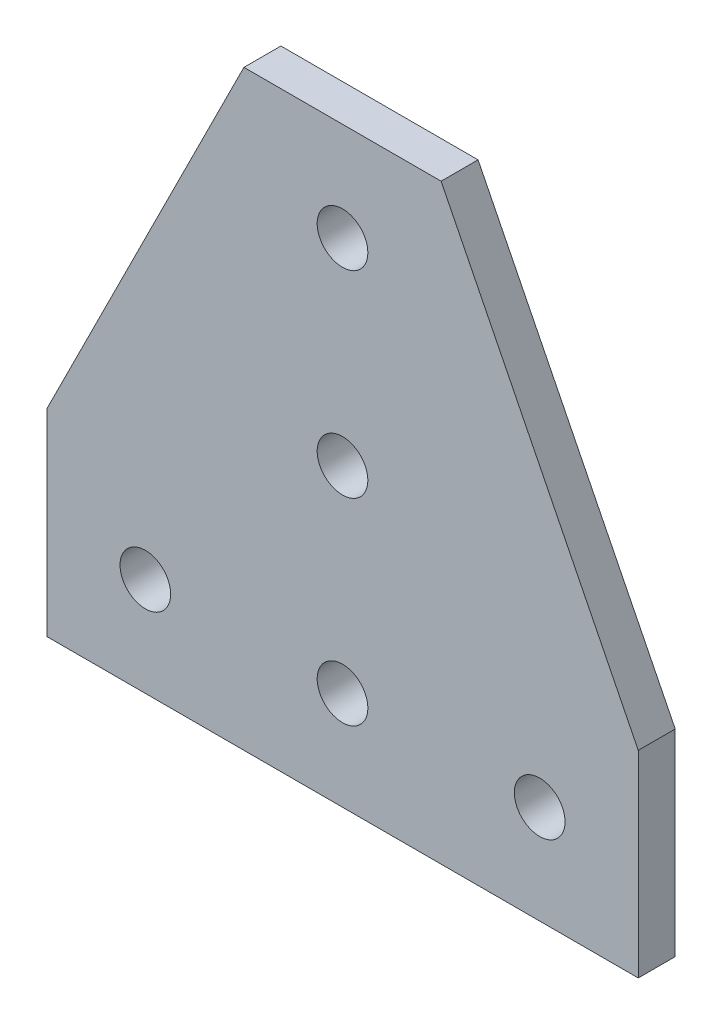
ISO-10303-21;
HEADER;
FILE_DESCRIPTION(('STEP AP214'),'2;1');
FILE_NAME('part.step','',(''),(''),'','','');
FILE_SCHEMA(('AUTOMOTIVE_DESIGN { 1 0 10303 214 1 1 1 1 }'));
ENDSEC;
DATA;
#1=APPLICATION_CONTEXT('core data for automotive mechanical design processes');
#2=APPLICATION_PROTOCOL_DEFINITION('international standard','automotive_design',2000,#1);
#3=PRODUCT_CONTEXT('',#1,'mechanical');
#4=PRODUCT('Part','Part','',(#3));
#5=PRODUCT_RELATED_PRODUCT_CATEGORY('part','',(#4));
#6=PRODUCT_DEFINITION_FORMATION('','',#4);
#7=PRODUCT_DEFINITION_CONTEXT('part definition',#1,'design');
#8=PRODUCT_DEFINITION('design','',#6,#7);
#9=PRODUCT_DEFINITION_SHAPE('','',#8);
#10=(LENGTH_UNIT() NAMED_UNIT(*) SI_UNIT(.MILLI.,.METRE.));
#11=(NAMED_UNIT(*) PLANE_ANGLE_UNIT() SI_UNIT($,.RADIAN.));
#12=(NAMED_UNIT(*) SI_UNIT($,.STERADIAN.) SOLID_ANGLE_UNIT());
#13=UNCERTAINTY_MEASURE_WITH_UNIT(LENGTH_MEASURE(1.E-05),#10,'distance_accuracy_value','');
#14=(GEOMETRIC_REPRESENTATION_CONTEXT(3) GLOBAL_UNCERTAINTY_ASSIGNED_CONTEXT((#13)) GLOBAL_UNIT_ASSIGNED_CONTEXT((#10,
#11,#12)) REPRESENTATION_CONTEXT('',''));
#15=CARTESIAN_POINT('',(0.,0.,0.));
#16=DIRECTION('',(0.,0.,1.));
#17=DIRECTION('',(1.,0.,0.));
#18=AXIS2_PLACEMENT_3D('',#15,#16,#17);
#19=CARTESIAN_POINT('',(0.,0.,2.38125));
#20=DIRECTION('',(0.,0.,-1.));
#21=DIRECTION('',(-1.,0.,0.));
#22=AXIS2_PLACEMENT_3D('',#19,#20,#21);
#23=PLANE('',#22);
#24=CARTESIAN_POINT('',(38.1,63.5,2.38125));
#25=DIRECTION('',(0.,0.,1.));
#26=DIRECTION('',(1.,0.,0.));
#27=AXIS2_PLACEMENT_3D('',#24,#25,#26);
#28=CIRCLE('',#27,3.26390000000001);
#29=CARTESIAN_POINT('',(41.3639,63.5,2.38125));
#30=VERTEX_POINT('',#29);
#31=EDGE_CURVE('E195',#30,#30,#28,.T.);
#32=ORIENTED_EDGE('',*,*,#31,.F.);
#33=EDGE_LOOP('',(#32));
#34=FACE_BOUND('',#33,.T.);
#35=CARTESIAN_POINT('',(38.1,12.7,2.38125));
#36=DIRECTION('',(0.,0.,1.));
#37=DIRECTION('',(1.,0.,0.));
#38=AXIS2_PLACEMENT_3D('',#35,#36,#37);
#39=CIRCLE('',#38,3.26389999999999);
#40=CARTESIAN_POINT('',(41.3639,12.7,2.38125));
#41=VERTEX_POINT('',#40);
#42=EDGE_CURVE('E207',#41,#41,#39,.T.);
#43=ORIENTED_EDGE('',*,*,#42,.F.);
#44=EDGE_LOOP('',(#43));
#45=FACE_BOUND('',#44,.T.);
#46=DIRECTION('',(1.,0.,0.));
#47=VECTOR('',#46,1.);
#48=CARTESIAN_POINT('',(76.2,0.,2.38125));
#49=LINE('',#48,#47);
#50=CARTESIAN_POINT('',(0.,0.,2.38125));
#51=VERTEX_POINT('',#50);
#52=CARTESIAN_POINT('',(76.2,0.,2.38125));
#53=VERTEX_POINT('',#52);
#54=EDGE_CURVE('E130',#51,#53,#49,.T.);
#55=ORIENTED_EDGE('',*,*,#54,.T.);
#56=DIRECTION('',(0.,1.,0.));
#57=VECTOR('',#56,1.);
#58=CARTESIAN_POINT('',(76.2,25.4,2.38125));
#59=LINE('',#58,#57);
#60=CARTESIAN_POINT('',(76.2,25.4,2.38125));
#61=VERTEX_POINT('',#60);
#62=EDGE_CURVE('E88',#53,#61,#59,.T.);
#63=ORIENTED_EDGE('',*,*,#62,.T.);
#64=DIRECTION('',(-0.447213595499958,0.894427190999916,0.));
#65=VECTOR('',#64,1.);
#66=CARTESIAN_POINT('',(76.2,25.4,2.38125));
#67=LINE('',#66,#65);
#68=CARTESIAN_POINT('',(50.8,76.2,2.38125));
#69=VERTEX_POINT('',#68);
#70=EDGE_CURVE('E101',#61,#69,#67,.T.);
#71=ORIENTED_EDGE('',*,*,#70,.T.);
#72=DIRECTION('',(-1.,0.,0.));
#73=VECTOR('',#72,1.);
#74=CARTESIAN_POINT('',(25.4,76.2,2.38125));
#75=LINE('',#74,#73);
#76=CARTESIAN_POINT('',(25.4,76.2,2.38125));
#77=VERTEX_POINT('',#76);
#78=EDGE_CURVE('E95',#69,#77,#75,.T.);
#79=ORIENTED_EDGE('',*,*,#78,.T.);
#80=DIRECTION('',(-0.447213595499958,-0.894427190999916,0.));
#81=VECTOR('',#80,1.);
#82=CARTESIAN_POINT('',(0.,25.4,2.38125));
#83=LINE('',#82,#81);
#84=CARTESIAN_POINT('',(0.,25.4,2.38125));
#85=VERTEX_POINT('',#84);
#86=EDGE_CURVE('E99',#77,#85,#83,.T.);
#87=ORIENTED_EDGE('',*,*,#86,.T.);
#88=DIRECTION('',(0.,-1.,0.));
#89=VECTOR('',#88,1.);
#90=CARTESIAN_POINT('',(0.,0.,2.38125));
#91=LINE('',#90,#89);
#92=EDGE_CURVE('E51',#85,#51,#91,.T.);
#93=ORIENTED_EDGE('',*,*,#92,.T.);
#94=EDGE_LOOP('',(#55,#63,#71,#79,#87,#93));
#95=FACE_BOUND('',#94,.T.);
#96=CARTESIAN_POINT('',(12.7,12.7,2.38125));
#97=DIRECTION('',(0.,0.,1.));
#98=DIRECTION('',(1.,0.,0.));
#99=AXIS2_PLACEMENT_3D('',#96,#97,#98);
#100=CIRCLE('',#99,3.2639);
#101=CARTESIAN_POINT('',(15.9639,12.7,2.38125));
#102=VERTEX_POINT('',#101);
#103=EDGE_CURVE('E123',#102,#102,#100,.T.);
#104=ORIENTED_EDGE('',*,*,#103,.F.);
#105=EDGE_LOOP('',(#104));
#106=FACE_BOUND('',#105,.T.);
#107=CARTESIAN_POINT('',(63.5,12.7,2.38125));
#108=DIRECTION('',(0.,0.,1.));
#109=DIRECTION('',(1.,0.,0.));
#110=AXIS2_PLACEMENT_3D('',#107,#108,#109);
#111=CIRCLE('',#110,3.26389999999999);
#112=CARTESIAN_POINT('',(66.7639,12.7,2.38125));
#113=VERTEX_POINT('',#112);
#114=EDGE_CURVE('E201',#113,#113,#111,.T.);
#115=ORIENTED_EDGE('',*,*,#114,.F.);
#116=EDGE_LOOP('',(#115));
#117=FACE_BOUND('',#116,.T.);
#118=CARTESIAN_POINT('',(38.1,38.1,2.38125));
#119=DIRECTION('',(0.,0.,1.));
#120=DIRECTION('',(1.,0.,0.));
#121=AXIS2_PLACEMENT_3D('',#118,#119,#120);
#122=CIRCLE('',#121,3.26389999999999);
#123=CARTESIAN_POINT('',(41.3639,38.1,2.38125));
#124=VERTEX_POINT('',#123);
#125=EDGE_CURVE('E186',#124,#124,#122,.T.);
#126=ORIENTED_EDGE('',*,*,#125,.F.);
#127=EDGE_LOOP('',(#126));
#128=FACE_BOUND('',#127,.T.);
#129=ADVANCED_FACE('F34',(#34,#45,#95,#106,#117,#128),#23,.F.);
#130=CARTESIAN_POINT('',(0.,0.,-2.38125));
#131=DIRECTION('',(0.,0.,-1.));
#132=DIRECTION('',(-1.,0.,0.));
#133=AXIS2_PLACEMENT_3D('',#130,#131,#132);
#134=PLANE('',#133);
#135=CARTESIAN_POINT('',(38.1,63.5,-2.38125));
#136=DIRECTION('',(0.,0.,1.));
#137=DIRECTION('',(1.,0.,0.));
#138=AXIS2_PLACEMENT_3D('',#135,#136,#137);
#139=CIRCLE('',#138,3.26390000000001);
#140=CARTESIAN_POINT('',(41.3639,63.5,-2.38125));
#141=VERTEX_POINT('',#140);
#142=EDGE_CURVE('E192',#141,#141,#139,.T.);
#143=ORIENTED_EDGE('',*,*,#142,.T.);
#144=EDGE_LOOP('',(#143));
#145=FACE_BOUND('',#144,.T.);
#146=CARTESIAN_POINT('',(38.1,12.7,-2.38125));
#147=DIRECTION('',(0.,0.,1.));
#148=DIRECTION('',(1.,0.,0.));
#149=AXIS2_PLACEMENT_3D('',#146,#147,#148);
#150=CIRCLE('',#149,3.26389999999999);
#151=CARTESIAN_POINT('',(41.3639,12.7,-2.38125));
#152=VERTEX_POINT('',#151);
#153=EDGE_CURVE('E204',#152,#152,#150,.T.);
#154=ORIENTED_EDGE('',*,*,#153,.T.);
#155=EDGE_LOOP('',(#154));
#156=FACE_BOUND('',#155,.T.);
#157=DIRECTION('',(1.,0.,0.));
#158=VECTOR('',#157,1.);
#159=CARTESIAN_POINT('',(76.2,0.,-2.38125));
#160=LINE('',#159,#158);
#161=CARTESIAN_POINT('',(0.,0.,-2.38125));
#162=VERTEX_POINT('',#161);
#163=CARTESIAN_POINT('',(76.2,0.,-2.38125));
#164=VERTEX_POINT('',#163);
#165=EDGE_CURVE('E119',#162,#164,#160,.T.);
#166=ORIENTED_EDGE('',*,*,#165,.F.);
#167=DIRECTION('',(0.,-1.,0.));
#168=VECTOR('',#167,1.);
#169=CARTESIAN_POINT('',(0.,0.,-2.38125));
#170=LINE('',#169,#168);
#171=CARTESIAN_POINT('',(0.,25.4,-2.38125));
#172=VERTEX_POINT('',#171);
#173=EDGE_CURVE('E80',#172,#162,#170,.T.);
#174=ORIENTED_EDGE('',*,*,#173,.F.);
#175=DIRECTION('',(-0.447213595499958,-0.894427190999916,0.));
#176=VECTOR('',#175,1.);
#177=CARTESIAN_POINT('',(0.,25.4,-2.38125));
#178=LINE('',#177,#176);
#179=CARTESIAN_POINT('',(25.4,76.2,-2.38125));
#180=VERTEX_POINT('',#179);
#181=EDGE_CURVE('E74',#180,#172,#178,.T.);
#182=ORIENTED_EDGE('',*,*,#181,.F.);
#183=DIRECTION('',(-1.,0.,0.));
#184=VECTOR('',#183,1.);
#185=CARTESIAN_POINT('',(25.4,76.2,-2.38125));
#186=LINE('',#185,#184);
#187=CARTESIAN_POINT('',(50.8,76.2,-2.38125));
#188=VERTEX_POINT('',#187);
#189=EDGE_CURVE('E109',#188,#180,#186,.T.);
#190=ORIENTED_EDGE('',*,*,#189,.F.);
#191=DIRECTION('',(-0.447213595499958,0.894427190999916,0.));
#192=VECTOR('',#191,1.);
#193=CARTESIAN_POINT('',(76.2,25.4,-2.38125));
#194=LINE('',#193,#192);
#195=CARTESIAN_POINT('',(76.2,25.4,-2.38125));
#196=VERTEX_POINT('',#195);
#197=EDGE_CURVE('E125',#196,#188,#194,.T.);
#198=ORIENTED_EDGE('',*,*,#197,.F.);
#199=DIRECTION('',(0.,1.,0.));
#200=VECTOR('',#199,1.);
#201=CARTESIAN_POINT('',(76.2,25.4,-2.38125));
#202=LINE('',#201,#200);
#203=EDGE_CURVE('E122',#164,#196,#202,.T.);
#204=ORIENTED_EDGE('',*,*,#203,.F.);
#205=EDGE_LOOP('',(#166,#174,#182,#190,#198,#204));
#206=FACE_BOUND('',#205,.T.);
#207=CARTESIAN_POINT('',(12.7,12.7,-2.38125));
#208=DIRECTION('',(0.,0.,1.));
#209=DIRECTION('',(1.,0.,0.));
#210=AXIS2_PLACEMENT_3D('',#207,#208,#209);
#211=CIRCLE('',#210,3.2639);
#212=CARTESIAN_POINT('',(15.9639,12.7,-2.38125));
#213=VERTEX_POINT('',#212);
#214=EDGE_CURVE('E210',#213,#213,#211,.T.);
#215=ORIENTED_EDGE('',*,*,#214,.T.);
#216=EDGE_LOOP('',(#215));
#217=FACE_BOUND('',#216,.T.);
#218=CARTESIAN_POINT('',(63.5,12.7,-2.38125));
#219=DIRECTION('',(0.,0.,1.));
#220=DIRECTION('',(1.,0.,0.));
#221=AXIS2_PLACEMENT_3D('',#218,#219,#220);
#222=CIRCLE('',#221,3.26389999999999);
#223=CARTESIAN_POINT('',(66.7639,12.7,-2.38125));
#224=VERTEX_POINT('',#223);
#225=EDGE_CURVE('E198',#224,#224,#222,.T.);
#226=ORIENTED_EDGE('',*,*,#225,.T.);
#227=EDGE_LOOP('',(#226));
#228=FACE_BOUND('',#227,.T.);
#229=CARTESIAN_POINT('',(38.1,38.1,-2.38125));
#230=DIRECTION('',(0.,0.,1.));
#231=DIRECTION('',(1.,0.,0.));
#232=AXIS2_PLACEMENT_3D('',#229,#230,#231);
#233=CIRCLE('',#232,3.26389999999999);
#234=CARTESIAN_POINT('',(41.3639,38.1,-2.38125));
#235=VERTEX_POINT('',#234);
#236=EDGE_CURVE('E189',#235,#235,#233,.T.);
#237=ORIENTED_EDGE('',*,*,#236,.T.);
#238=EDGE_LOOP('',(#237));
#239=FACE_BOUND('',#238,.T.);
#240=ADVANCED_FACE('F139',(#145,#156,#206,#217,#228,#239),#134,.T.);
#241=CARTESIAN_POINT('',(76.2,0.,2.38125));
#242=DIRECTION('',(0.,1.,0.));
#243=DIRECTION('',(-1.,0.,0.));
#244=AXIS2_PLACEMENT_3D('',#241,#242,#243);
#245=PLANE('',#244);
#246=ORIENTED_EDGE('',*,*,#165,.T.);
#247=DIRECTION('',(0.,0.,-1.));
#248=VECTOR('',#247,1.);
#249=CARTESIAN_POINT('',(76.2,0.,2.38125));
#250=LINE('',#249,#248);
#251=EDGE_CURVE('E11',#53,#164,#250,.T.);
#252=ORIENTED_EDGE('',*,*,#251,.F.);
#253=ORIENTED_EDGE('',*,*,#54,.F.);
#254=DIRECTION('',(0.,0.,-1.));
#255=VECTOR('',#254,1.);
#256=CARTESIAN_POINT('',(0.,0.,2.38125));
#257=LINE('',#256,#255);
#258=EDGE_CURVE('E115',#51,#162,#257,.T.);
#259=ORIENTED_EDGE('',*,*,#258,.T.);
#260=EDGE_LOOP('',(#246,#252,#253,#259));
#261=FACE_BOUND('',#260,.T.);
#262=ADVANCED_FACE('F36',(#261),#245,.F.);
#263=CARTESIAN_POINT('',(76.2,25.4,2.38125));
#264=DIRECTION('',(-1.,0.,0.));
#265=DIRECTION('',(0.,0.,1.));
#266=AXIS2_PLACEMENT_3D('',#263,#264,#265);
#267=PLANE('',#266);
#268=ORIENTED_EDGE('',*,*,#203,.T.);
#269=DIRECTION('',(0.,0.,-1.));
#270=VECTOR('',#269,1.);
#271=CARTESIAN_POINT('',(76.2,25.4,2.38125));
#272=LINE('',#271,#270);
#273=EDGE_CURVE('E43',#61,#196,#272,.T.);
#274=ORIENTED_EDGE('',*,*,#273,.F.);
#275=ORIENTED_EDGE('',*,*,#62,.F.);
#276=ORIENTED_EDGE('',*,*,#251,.T.);
#277=EDGE_LOOP('',(#268,#274,#275,#276));
#278=FACE_BOUND('',#277,.T.);
#279=ADVANCED_FACE('F276',(#278),#267,.F.);
#280=CARTESIAN_POINT('',(76.2,25.4,2.38125));
#281=DIRECTION('',(-0.894427190999916,-0.447213595499958,0.));
#282=DIRECTION('',(0.447213595499958,-0.894427190999916,0.));
#283=AXIS2_PLACEMENT_3D('',#280,#281,#282);
#284=PLANE('',#283);
#285=ORIENTED_EDGE('',*,*,#197,.T.);
#286=DIRECTION('',(0.,0.,-1.));
#287=VECTOR('',#286,1.);
#288=CARTESIAN_POINT('',(50.8,76.2,2.38125));
#289=LINE('',#288,#287);
#290=EDGE_CURVE('E110',#69,#188,#289,.T.);
#291=ORIENTED_EDGE('',*,*,#290,.F.);
#292=ORIENTED_EDGE('',*,*,#70,.F.);
#293=ORIENTED_EDGE('',*,*,#273,.T.);
#294=EDGE_LOOP('',(#285,#291,#292,#293));
#295=FACE_BOUND('',#294,.T.);
#296=ADVANCED_FACE('F136',(#295),#284,.F.);
#297=CARTESIAN_POINT('',(25.4,76.2,2.38125));
#298=DIRECTION('',(0.,-1.,0.));
#299=DIRECTION('',(0.,0.,-1.));
#300=AXIS2_PLACEMENT_3D('',#297,#298,#299);
#301=PLANE('',#300);
#302=ORIENTED_EDGE('',*,*,#189,.T.);
#303=DIRECTION('',(0.,0.,-1.));
#304=VECTOR('',#303,1.);
#305=CARTESIAN_POINT('',(25.4,76.2,2.38125));
#306=LINE('',#305,#304);
#307=EDGE_CURVE('E106',#77,#180,#306,.T.);
#308=ORIENTED_EDGE('',*,*,#307,.F.);
#309=ORIENTED_EDGE('',*,*,#78,.F.);
#310=ORIENTED_EDGE('',*,*,#290,.T.);
#311=EDGE_LOOP('',(#302,#308,#309,#310));
#312=FACE_BOUND('',#311,.T.);
#313=ADVANCED_FACE('F107',(#312),#301,.F.);
#314=CARTESIAN_POINT('',(0.,25.4,2.38125));
#315=DIRECTION('',(0.894427190999916,-0.447213595499958,0.));
#316=DIRECTION('',(0.447213595499958,0.894427190999916,0.));
#317=AXIS2_PLACEMENT_3D('',#314,#315,#316);
#318=PLANE('',#317);
#319=ORIENTED_EDGE('',*,*,#181,.T.);
#320=DIRECTION('',(0.,0.,-1.));
#321=VECTOR('',#320,1.);
#322=CARTESIAN_POINT('',(0.,25.4,2.38125));
#323=LINE('',#322,#321);
#324=EDGE_CURVE('E111',#85,#172,#323,.T.);
#325=ORIENTED_EDGE('',*,*,#324,.F.);
#326=ORIENTED_EDGE('',*,*,#86,.F.);
#327=ORIENTED_EDGE('',*,*,#307,.T.);
#328=EDGE_LOOP('',(#319,#325,#326,#327));
#329=FACE_BOUND('',#328,.T.);
#330=ADVANCED_FACE('F113',(#329),#318,.F.);
#331=CARTESIAN_POINT('',(0.,0.,2.38125));
#332=DIRECTION('',(1.,0.,0.));
#333=DIRECTION('',(0.,0.,-1.));
#334=AXIS2_PLACEMENT_3D('',#331,#332,#333);
#335=PLANE('',#334);
#336=ORIENTED_EDGE('',*,*,#173,.T.);
#337=ORIENTED_EDGE('',*,*,#258,.F.);
#338=ORIENTED_EDGE('',*,*,#92,.F.);
#339=ORIENTED_EDGE('',*,*,#324,.T.);
#340=EDGE_LOOP('',(#336,#337,#338,#339));
#341=FACE_BOUND('',#340,.T.);
#342=ADVANCED_FACE('F144',(#341),#335,.F.);
#343=CARTESIAN_POINT('',(12.7,12.7,2.38125));
#344=DIRECTION('',(0.,0.,-1.));
#345=DIRECTION('',(-1.,0.,0.));
#346=AXIS2_PLACEMENT_3D('',#343,#344,#345);
#347=CYLINDRICAL_SURFACE('',#346,3.2639);
#348=ORIENTED_EDGE('',*,*,#103,.T.);
#349=EDGE_LOOP('',(#348));
#350=FACE_BOUND('',#349,.T.);
#351=ORIENTED_EDGE('',*,*,#214,.F.);
#352=EDGE_LOOP('',(#351));
#353=FACE_BOUND('',#352,.T.);
#354=ADVANCED_FACE('F146',(#350,#353),#347,.F.);
#355=CARTESIAN_POINT('',(38.1,12.7,2.38125));
#356=DIRECTION('',(0.,0.,-1.));
#357=DIRECTION('',(-1.,0.,0.));
#358=AXIS2_PLACEMENT_3D('',#355,#356,#357);
#359=CYLINDRICAL_SURFACE('',#358,3.26389999999999);
#360=ORIENTED_EDGE('',*,*,#42,.T.);
#361=EDGE_LOOP('',(#360));
#362=FACE_BOUND('',#361,.T.);
#363=ORIENTED_EDGE('',*,*,#153,.F.);
#364=EDGE_LOOP('',(#363));
#365=FACE_BOUND('',#364,.T.);
#366=ADVANCED_FACE('F152',(#362,#365),#359,.F.);
#367=CARTESIAN_POINT('',(63.5,12.7,2.38125));
#368=DIRECTION('',(0.,0.,-1.));
#369=DIRECTION('',(-1.,0.,0.));
#370=AXIS2_PLACEMENT_3D('',#367,#368,#369);
#371=CYLINDRICAL_SURFACE('',#370,3.26389999999999);
#372=ORIENTED_EDGE('',*,*,#114,.T.);
#373=EDGE_LOOP('',(#372));
#374=FACE_BOUND('',#373,.T.);
#375=ORIENTED_EDGE('',*,*,#225,.F.);
#376=EDGE_LOOP('',(#375));
#377=FACE_BOUND('',#376,.T.);
#378=ADVANCED_FACE('F169',(#374,#377),#371,.F.);
#379=CARTESIAN_POINT('',(38.1,63.5,2.38125));
#380=DIRECTION('',(0.,0.,-1.));
#381=DIRECTION('',(-1.,0.,0.));
#382=AXIS2_PLACEMENT_3D('',#379,#380,#381);
#383=CYLINDRICAL_SURFACE('',#382,3.26390000000001);
#384=ORIENTED_EDGE('',*,*,#31,.T.);
#385=EDGE_LOOP('',(#384));
#386=FACE_BOUND('',#385,.T.);
#387=ORIENTED_EDGE('',*,*,#142,.F.);
#388=EDGE_LOOP('',(#387));
#389=FACE_BOUND('',#388,.T.);
#390=ADVANCED_FACE('F173',(#386,#389),#383,.F.);
#391=CARTESIAN_POINT('',(38.1,38.1,2.38125));
#392=DIRECTION('',(0.,0.,-1.));
#393=DIRECTION('',(-1.,0.,0.));
#394=AXIS2_PLACEMENT_3D('',#391,#392,#393);
#395=CYLINDRICAL_SURFACE('',#394,3.26389999999999);
#396=ORIENTED_EDGE('',*,*,#125,.T.);
#397=EDGE_LOOP('',(#396));
#398=FACE_BOUND('',#397,.T.);
#399=ORIENTED_EDGE('',*,*,#236,.F.);
#400=EDGE_LOOP('',(#399));
#401=FACE_BOUND('',#400,.T.);
#402=ADVANCED_FACE('F177',(#398,#401),#395,.F.);
#403=CLOSED_SHELL('',(#129,#240,#262,#279,#296,#313,#330,#342,#354,#366,#378,#390,#402));
#404=MANIFOLD_SOLID_BREP('B2',#403);
#405=ADVANCED_BREP_SHAPE_REPRESENTATION('',(#18,#404),#14);
#406=SHAPE_DEFINITION_REPRESENTATION(#9,#405);
ENDSEC;
END-ISO-10303-21;
